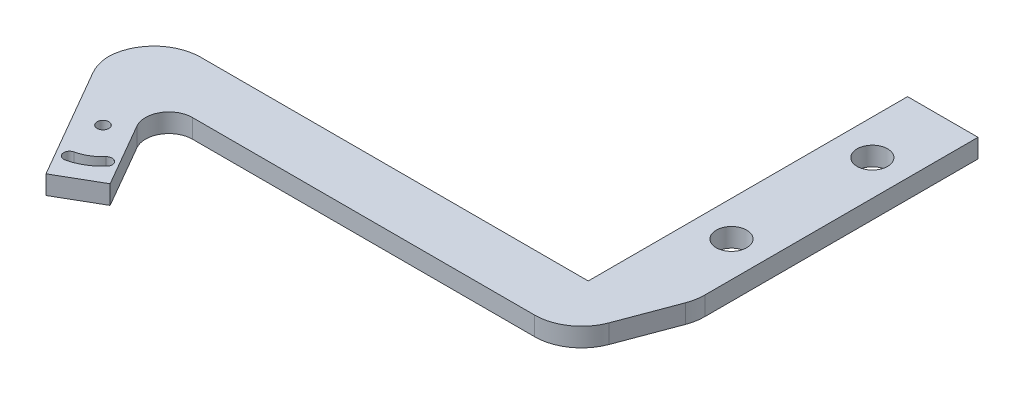
ISO-10303-21;
HEADER;
FILE_DESCRIPTION(('STEP AP214'),'2;1');
FILE_NAME('part.step','',(''),(''),'','','');
FILE_SCHEMA(('AUTOMOTIVE_DESIGN { 1 0 10303 214 1 1 1 1 }'));
ENDSEC;
DATA;
#1=APPLICATION_CONTEXT('core data for automotive mechanical design processes');
#2=APPLICATION_PROTOCOL_DEFINITION('international standard','automotive_design',2000,#1);
#3=PRODUCT_CONTEXT('',#1,'mechanical');
#4=PRODUCT('Part','Part','',(#3));
#5=PRODUCT_RELATED_PRODUCT_CATEGORY('part','',(#4));
#6=PRODUCT_DEFINITION_FORMATION('','',#4);
#7=PRODUCT_DEFINITION_CONTEXT('part definition',#1,'design');
#8=PRODUCT_DEFINITION('design','',#6,#7);
#9=PRODUCT_DEFINITION_SHAPE('','',#8);
#10=(LENGTH_UNIT() NAMED_UNIT(*) SI_UNIT(.MILLI.,.METRE.));
#11=(NAMED_UNIT(*) PLANE_ANGLE_UNIT() SI_UNIT($,.RADIAN.));
#12=(NAMED_UNIT(*) SI_UNIT($,.STERADIAN.) SOLID_ANGLE_UNIT());
#13=UNCERTAINTY_MEASURE_WITH_UNIT(LENGTH_MEASURE(1.E-05),#10,'distance_accuracy_value','');
#14=(GEOMETRIC_REPRESENTATION_CONTEXT(3) GLOBAL_UNCERTAINTY_ASSIGNED_CONTEXT((#13)) GLOBAL_UNIT_ASSIGNED_CONTEXT((#10,
#11,#12)) REPRESENTATION_CONTEXT('',''));
#15=CARTESIAN_POINT('',(0.,0.,0.));
#16=DIRECTION('',(0.,0.,1.));
#17=DIRECTION('',(1.,0.,0.));
#18=AXIS2_PLACEMENT_3D('',#15,#16,#17);
#19=CARTESIAN_POINT('',(0.,0.,0.));
#20=DIRECTION('',(0.,1.,0.));
#21=DIRECTION('',(0.,0.,1.));
#22=AXIS2_PLACEMENT_3D('',#19,#20,#21);
#23=PLANE('',#22);
#24=CARTESIAN_POINT('',(163.094010767585,0.,-15.));
#25=DIRECTION('',(0.,1.,0.));
#26=DIRECTION('',(0.,0.,1.));
#27=AXIS2_PLACEMENT_3D('',#24,#25,#26);
#28=CIRCLE('',#27,3.25000000000001);
#29=CARTESIAN_POINT('',(163.094010767585,0.,-11.75));
#30=VERTEX_POINT('',#29);
#31=EDGE_CURVE('E236',#30,#30,#28,.T.);
#32=ORIENTED_EDGE('',*,*,#31,.T.);
#33=EDGE_LOOP('',(#32));
#34=FACE_BOUND('',#33,.T.);
#35=CARTESIAN_POINT('',(163.094010767585,0.,15.));
#36=DIRECTION('',(0.,1.,0.));
#37=DIRECTION('',(0.,0.,1.));
#38=AXIS2_PLACEMENT_3D('',#35,#36,#37);
#39=CIRCLE('',#38,3.25000000000001);
#40=CARTESIAN_POINT('',(163.094010767585,0.,18.25));
#41=VERTEX_POINT('',#40);
#42=EDGE_CURVE('E243',#41,#41,#39,.T.);
#43=ORIENTED_EDGE('',*,*,#42,.T.);
#44=EDGE_LOOP('',(#43));
#45=FACE_BOUND('',#44,.T.);
#46=CARTESIAN_POINT('',(75.1741377865071,0.,60.9233937586589));
#47=DIRECTION('',(0.,1.,0.));
#48=DIRECTION('',(0.,0.,1.));
#49=AXIS2_PLACEMENT_3D('',#46,#47,#48);
#50=CIRCLE('',#49,1.25);
#51=CARTESIAN_POINT('',(75.1741377865071,0.,62.1733937586589));
#52=VERTEX_POINT('',#51);
#53=EDGE_CURVE('E249',#52,#52,#50,.T.);
#54=ORIENTED_EDGE('',*,*,#53,.T.);
#55=EDGE_LOOP('',(#54));
#56=FACE_BOUND('',#55,.T.);
#57=DIRECTION('',(-0.499999999999998,0.,-0.86602540378444));
#58=VECTOR('',#57,1.);
#59=CARTESIAN_POINT('',(78.0940107675848,0.,75.9807621135332));
#60=LINE('',#59,#58);
#61=CARTESIAN_POINT('',(78.0940107675848,0.,75.9807621135332));
#62=VERTEX_POINT('',#61);
#63=CARTESIAN_POINT('',(64.4337567297405,0.,52.3205080756888));
#64=VERTEX_POINT('',#63);
#65=EDGE_CURVE('E261',#62,#64,#60,.T.);
#66=ORIENTED_EDGE('',*,*,#65,.T.);
#67=CARTESIAN_POINT('',(73.0940107675849,0.,47.3205080756888));
#68=DIRECTION('',(0.,1.,0.));
#69=DIRECTION('',(0.,0.,1.));
#70=AXIS2_PLACEMENT_3D('',#67,#68,#69);
#71=CIRCLE('',#70,10.);
#72=CARTESIAN_POINT('',(63.0997837999201,0.,47.6602540378444));
#73=VERTEX_POINT('',#72);
#74=EDGE_CURVE('E323',#64,#73,#71,.F.);
#75=ORIENTED_EDGE('',*,*,#74,.T.);
#76=CARTESIAN_POINT('',(73.0940107675849,0.,48.));
#77=DIRECTION('',(0.,1.,0.));
#78=DIRECTION('',(0.,0.,1.));
#79=AXIS2_PLACEMENT_3D('',#76,#77,#78);
#80=CIRCLE('',#79,10.);
#81=CARTESIAN_POINT('',(73.0940107675849,0.,38.));
#82=VERTEX_POINT('',#81);
#83=EDGE_CURVE('E321',#73,#82,#80,.F.);
#84=ORIENTED_EDGE('',*,*,#83,.T.);
#85=DIRECTION('',(1.,0.,0.));
#86=VECTOR('',#85,1.);
#87=CARTESIAN_POINT('',(155.594010767585,0.,38.));
#88=LINE('',#87,#86);
#89=CARTESIAN_POINT('',(155.594010767585,0.,38.));
#90=VERTEX_POINT('',#89);
#91=EDGE_CURVE('E252',#82,#90,#88,.T.);
#92=ORIENTED_EDGE('',*,*,#91,.T.);
#93=DIRECTION('',(0.,0.,1.));
#94=VECTOR('',#93,1.);
#95=CARTESIAN_POINT('',(155.594010767585,0.,0.));
#96=LINE('',#95,#94);
#97=CARTESIAN_POINT('',(155.594010767585,0.,-30.));
#98=VERTEX_POINT('',#97);
#99=EDGE_CURVE('E266',#98,#90,#96,.T.);
#100=ORIENTED_EDGE('',*,*,#99,.F.);
#101=DIRECTION('',(-1.,0.,0.));
#102=VECTOR('',#101,1.);
#103=CARTESIAN_POINT('',(0.,0.,-30.));
#104=LINE('',#103,#102);
#105=CARTESIAN_POINT('',(170.594010767585,0.,-30.));
#106=VERTEX_POINT('',#105);
#107=EDGE_CURVE('E287',#106,#98,#104,.T.);
#108=ORIENTED_EDGE('',*,*,#107,.F.);
#109=DIRECTION('',(0.,0.,1.));
#110=VECTOR('',#109,1.);
#111=CARTESIAN_POINT('',(170.594010767585,0.,0.));
#112=LINE('',#111,#110);
#113=CARTESIAN_POINT('',(170.594010767585,0.,28.1866541822749));
#114=VERTEX_POINT('',#113);
#115=EDGE_CURVE('E284',#106,#114,#112,.T.);
#116=ORIENTED_EDGE('',*,*,#115,.T.);
#117=CARTESIAN_POINT('',(160.594010767585,0.,28.1866541822749));
#118=DIRECTION('',(0.,1.,0.));
#119=DIRECTION('',(0.,0.,1.));
#120=AXIS2_PLACEMENT_3D('',#117,#118,#119);
#121=CIRCLE('',#120,10.);
#122=CARTESIAN_POINT('',(169.957302543275,0.,31.6978885981588));
#123=VERTEX_POINT('',#122);
#124=EDGE_CURVE('E317',#114,#123,#121,.F.);
#125=ORIENTED_EDGE('',*,*,#124,.T.);
#126=DIRECTION('',(0.351123441588391,0.,-0.936329177569045));
#127=VECTOR('',#126,1.);
#128=CARTESIAN_POINT('',(159.424886152403,0.,59.784332307151));
#129=LINE('',#128,#127);
#130=CARTESIAN_POINT('',(165.527297861628,0.,43.5112344158839));
#131=VERTEX_POINT('',#130);
#132=EDGE_CURVE('E280',#131,#123,#129,.T.);
#133=ORIENTED_EDGE('',*,*,#132,.F.);
#134=CARTESIAN_POINT('',(156.164006085938,0.,40.));
#135=DIRECTION('',(0.,1.,0.));
#136=DIRECTION('',(0.,0.,1.));
#137=AXIS2_PLACEMENT_3D('',#134,#135,#136);
#138=CIRCLE('',#137,10.);
#139=CARTESIAN_POINT('',(156.164006085938,0.,50.));
#140=VERTEX_POINT('',#139);
#141=EDGE_CURVE('E319',#131,#140,#138,.F.);
#142=ORIENTED_EDGE('',*,*,#141,.T.);
#143=DIRECTION('',(-1.,0.,0.));
#144=VECTOR('',#143,1.);
#145=CARTESIAN_POINT('',(0.,0.,50.));
#146=LINE('',#145,#144);
#147=CARTESIAN_POINT('',(83.3012701892217,0.,50.));
#148=VERTEX_POINT('',#147);
#149=EDGE_CURVE('E278',#140,#148,#146,.T.);
#150=ORIENTED_EDGE('',*,*,#149,.T.);
#151=CARTESIAN_POINT('',(83.3012701892217,0.,55.));
#152=DIRECTION('',(0.,1.,0.));
#153=DIRECTION('',(0.,0.,1.));
#154=AXIS2_PLACEMENT_3D('',#151,#152,#153);
#155=CIRCLE('',#154,5.);
#156=CARTESIAN_POINT('',(78.9711431702995,0.,57.5));
#157=VERTEX_POINT('',#156);
#158=EDGE_CURVE('E81',#148,#157,#155,.T.);
#159=ORIENTED_EDGE('',*,*,#158,.T.);
#160=DIRECTION('',(-0.499999999999998,0.,-0.86602540378444));
#161=VECTOR('',#160,1.);
#162=CARTESIAN_POINT('',(86.7542648054292,0.,70.9807621135332));
#163=LINE('',#162,#161);
#164=CARTESIAN_POINT('',(86.7542648054292,0.,70.9807621135332));
#165=VERTEX_POINT('',#164);
#166=EDGE_CURVE('E309',#165,#157,#163,.T.);
#167=ORIENTED_EDGE('',*,*,#166,.F.);
#168=DIRECTION('',(-0.866025403784441,0.,0.499999999999996));
#169=VECTOR('',#168,1.);
#170=CARTESIAN_POINT('',(86.7542648054292,0.,70.9807621135332));
#171=LINE('',#170,#169);
#172=EDGE_CURVE('E300',#165,#62,#171,.T.);
#173=ORIENTED_EDGE('',*,*,#172,.T.);
#174=EDGE_LOOP('',(#66,#75,#84,#92,#100,#108,#116,#125,#133,#142,#150,#159,#167,#173));
#175=FACE_BOUND('',#174,.T.);
#176=CARTESIAN_POINT('',(75.1741377865071,0.,60.9233937586589));
#177=DIRECTION('',(0.,1.,0.));
#178=DIRECTION('',(0.,0.,-1.));
#179=AXIS2_PLACEMENT_3D('',#176,#177,#178);
#180=CIRCLE('',#179,10.75);
#181=CARTESIAN_POINT('',(77.5923616207036,0.,71.3978719551002));
#182=VERTEX_POINT('',#181);
#183=CARTESIAN_POINT('',(83.1629446603891,0.,68.1165477770166));
#184=VERTEX_POINT('',#183);
#185=EDGE_CURVE('E208',#182,#184,#180,.T.);
#186=ORIENTED_EDGE('',*,*,#185,.T.);
#187=CARTESIAN_POINT('',(82.2340136285423,0.,67.280134519068));
#188=DIRECTION('',(0.,1.,0.));
#189=DIRECTION('',(0.,0.,1.));
#190=AXIS2_PLACEMENT_3D('',#187,#188,#189);
#191=CIRCLE('',#190,1.25);
#192=CARTESIAN_POINT('',(81.3050825966956,0.,66.4437212611194));
#193=VERTEX_POINT('',#192);
#194=EDGE_CURVE('E202',#184,#193,#191,.T.);
#195=ORIENTED_EDGE('',*,*,#194,.T.);
#196=CARTESIAN_POINT('',(75.1741377865071,0.,60.9233937586589));
#197=DIRECTION('',(0.,-1.,0.));
#198=DIRECTION('',(0.,0.,-1.));
#199=AXIS2_PLACEMENT_3D('',#196,#197,#198);
#200=CIRCLE('',#199,8.25);
#201=CARTESIAN_POINT('',(77.0299839848439,0.,68.9619467931371));
#202=VERTEX_POINT('',#201);
#203=EDGE_CURVE('E88',#193,#202,#200,.T.);
#204=ORIENTED_EDGE('',*,*,#203,.T.);
#205=CARTESIAN_POINT('',(77.3111728027738,0.,70.1799093741186));
#206=DIRECTION('',(0.,1.,0.));
#207=DIRECTION('',(0.,0.,1.));
#208=AXIS2_PLACEMENT_3D('',#205,#206,#207);
#209=CIRCLE('',#208,1.25);
#210=EDGE_CURVE('E213',#202,#182,#209,.T.);
#211=ORIENTED_EDGE('',*,*,#210,.T.);
#212=EDGE_LOOP('',(#186,#195,#204,#211));
#213=FACE_BOUND('',#212,.T.);
#214=ADVANCED_FACE('F73',(#34,#45,#56,#175,#213),#23,.F.);
#215=CARTESIAN_POINT('',(0.,4.,0.));
#216=DIRECTION('',(0.,1.,0.));
#217=DIRECTION('',(0.,0.,1.));
#218=AXIS2_PLACEMENT_3D('',#215,#216,#217);
#219=PLANE('',#218);
#220=CARTESIAN_POINT('',(163.094010767585,4.,-15.));
#221=DIRECTION('',(0.,1.,0.));
#222=DIRECTION('',(0.,0.,1.));
#223=AXIS2_PLACEMENT_3D('',#220,#221,#222);
#224=CIRCLE('',#223,3.25000000000001);
#225=CARTESIAN_POINT('',(163.094010767585,4.,-11.75));
#226=VERTEX_POINT('',#225);
#227=EDGE_CURVE('E240',#226,#226,#224,.T.);
#228=ORIENTED_EDGE('',*,*,#227,.F.);
#229=EDGE_LOOP('',(#228));
#230=FACE_BOUND('',#229,.T.);
#231=CARTESIAN_POINT('',(163.094010767585,4.,15.));
#232=DIRECTION('',(0.,1.,0.));
#233=DIRECTION('',(0.,0.,1.));
#234=AXIS2_PLACEMENT_3D('',#231,#232,#233);
#235=CIRCLE('',#234,3.25000000000001);
#236=CARTESIAN_POINT('',(163.094010767585,4.,18.25));
#237=VERTEX_POINT('',#236);
#238=EDGE_CURVE('E246',#237,#237,#235,.T.);
#239=ORIENTED_EDGE('',*,*,#238,.F.);
#240=EDGE_LOOP('',(#239));
#241=FACE_BOUND('',#240,.T.);
#242=CARTESIAN_POINT('',(75.1741377865071,4.,60.9233937586589));
#243=DIRECTION('',(0.,1.,0.));
#244=DIRECTION('',(0.,0.,1.));
#245=AXIS2_PLACEMENT_3D('',#242,#243,#244);
#246=CIRCLE('',#245,1.25);
#247=CARTESIAN_POINT('',(75.1741377865071,4.,62.1733937586589));
#248=VERTEX_POINT('',#247);
#249=EDGE_CURVE('E239',#248,#248,#246,.T.);
#250=ORIENTED_EDGE('',*,*,#249,.F.);
#251=EDGE_LOOP('',(#250));
#252=FACE_BOUND('',#251,.T.);
#253=CARTESIAN_POINT('',(73.0940107675849,4.,48.));
#254=DIRECTION('',(0.,1.,0.));
#255=DIRECTION('',(0.,0.,1.));
#256=AXIS2_PLACEMENT_3D('',#253,#254,#255);
#257=CIRCLE('',#256,10.);
#258=CARTESIAN_POINT('',(73.0940107675849,4.,38.));
#259=VERTEX_POINT('',#258);
#260=CARTESIAN_POINT('',(63.0997837999201,4.,47.6602540378444));
#261=VERTEX_POINT('',#260);
#262=EDGE_CURVE('E329',#259,#261,#257,.T.);
#263=ORIENTED_EDGE('',*,*,#262,.T.);
#264=CARTESIAN_POINT('',(73.0940107675849,4.,47.3205080756888));
#265=DIRECTION('',(0.,1.,0.));
#266=DIRECTION('',(0.,0.,1.));
#267=AXIS2_PLACEMENT_3D('',#264,#265,#266);
#268=CIRCLE('',#267,10.);
#269=CARTESIAN_POINT('',(64.4337567297405,4.,52.3205080756888));
#270=VERTEX_POINT('',#269);
#271=EDGE_CURVE('E331',#261,#270,#268,.T.);
#272=ORIENTED_EDGE('',*,*,#271,.T.);
#273=DIRECTION('',(-0.499999999999998,0.,-0.86602540378444));
#274=VECTOR('',#273,1.);
#275=CARTESIAN_POINT('',(78.0940107675848,4.,75.9807621135332));
#276=LINE('',#275,#274);
#277=CARTESIAN_POINT('',(78.0940107675848,4.,75.9807621135332));
#278=VERTEX_POINT('',#277);
#279=EDGE_CURVE('E296',#278,#270,#276,.T.);
#280=ORIENTED_EDGE('',*,*,#279,.F.);
#281=DIRECTION('',(-0.866025403784441,0.,0.499999999999996));
#282=VECTOR('',#281,1.);
#283=CARTESIAN_POINT('',(86.7542648054292,4.,70.9807621135332));
#284=LINE('',#283,#282);
#285=CARTESIAN_POINT('',(86.7542648054292,4.,70.9807621135332));
#286=VERTEX_POINT('',#285);
#287=EDGE_CURVE('E303',#286,#278,#284,.T.);
#288=ORIENTED_EDGE('',*,*,#287,.F.);
#289=DIRECTION('',(-0.499999999999998,0.,-0.86602540378444));
#290=VECTOR('',#289,1.);
#291=CARTESIAN_POINT('',(86.7542648054292,4.,70.9807621135332));
#292=LINE('',#291,#290);
#293=CARTESIAN_POINT('',(78.9711431702995,4.,57.5));
#294=VERTEX_POINT('',#293);
#295=EDGE_CURVE('E299',#286,#294,#292,.T.);
#296=ORIENTED_EDGE('',*,*,#295,.T.);
#297=CARTESIAN_POINT('',(83.3012701892217,4.,55.));
#298=DIRECTION('',(0.,1.,0.));
#299=DIRECTION('',(0.,0.,1.));
#300=AXIS2_PLACEMENT_3D('',#297,#298,#299);
#301=CIRCLE('',#300,5.);
#302=CARTESIAN_POINT('',(83.3012701892217,4.,50.));
#303=VERTEX_POINT('',#302);
#304=EDGE_CURVE('E12',#294,#303,#301,.F.);
#305=ORIENTED_EDGE('',*,*,#304,.T.);
#306=DIRECTION('',(-1.,0.,0.));
#307=VECTOR('',#306,1.);
#308=CARTESIAN_POINT('',(0.,4.,50.));
#309=LINE('',#308,#307);
#310=CARTESIAN_POINT('',(156.164006085938,4.,50.));
#311=VERTEX_POINT('',#310);
#312=EDGE_CURVE('E262',#311,#303,#309,.T.);
#313=ORIENTED_EDGE('',*,*,#312,.F.);
#314=CARTESIAN_POINT('',(156.164006085938,4.,40.));
#315=DIRECTION('',(0.,1.,0.));
#316=DIRECTION('',(0.,0.,1.));
#317=AXIS2_PLACEMENT_3D('',#314,#315,#316);
#318=CIRCLE('',#317,10.);
#319=CARTESIAN_POINT('',(165.527297861628,4.,43.5112344158839));
#320=VERTEX_POINT('',#319);
#321=EDGE_CURVE('E327',#311,#320,#318,.T.);
#322=ORIENTED_EDGE('',*,*,#321,.T.);
#323=DIRECTION('',(0.351123441588391,0.,-0.936329177569045));
#324=VECTOR('',#323,1.);
#325=CARTESIAN_POINT('',(159.424886152403,4.,59.784332307151));
#326=LINE('',#325,#324);
#327=CARTESIAN_POINT('',(169.957302543275,4.,31.6978885981588));
#328=VERTEX_POINT('',#327);
#329=EDGE_CURVE('E265',#320,#328,#326,.T.);
#330=ORIENTED_EDGE('',*,*,#329,.T.);
#331=CARTESIAN_POINT('',(160.594010767585,4.,28.1866541822749));
#332=DIRECTION('',(0.,1.,0.));
#333=DIRECTION('',(0.,0.,1.));
#334=AXIS2_PLACEMENT_3D('',#331,#332,#333);
#335=CIRCLE('',#334,10.);
#336=CARTESIAN_POINT('',(170.594010767585,4.,28.1866541822749));
#337=VERTEX_POINT('',#336);
#338=EDGE_CURVE('E325',#328,#337,#335,.T.);
#339=ORIENTED_EDGE('',*,*,#338,.T.);
#340=DIRECTION('',(0.,0.,1.));
#341=VECTOR('',#340,1.);
#342=CARTESIAN_POINT('',(170.594010767585,4.,0.));
#343=LINE('',#342,#341);
#344=CARTESIAN_POINT('',(170.594010767585,4.,-30.));
#345=VERTEX_POINT('',#344);
#346=EDGE_CURVE('E269',#345,#337,#343,.T.);
#347=ORIENTED_EDGE('',*,*,#346,.F.);
#348=DIRECTION('',(-1.,0.,0.));
#349=VECTOR('',#348,1.);
#350=CARTESIAN_POINT('',(0.,4.,-30.));
#351=LINE('',#350,#349);
#352=CARTESIAN_POINT('',(155.594010767585,4.,-30.));
#353=VERTEX_POINT('',#352);
#354=EDGE_CURVE('E272',#345,#353,#351,.T.);
#355=ORIENTED_EDGE('',*,*,#354,.T.);
#356=DIRECTION('',(0.,0.,1.));
#357=VECTOR('',#356,1.);
#358=CARTESIAN_POINT('',(155.594010767585,4.,0.));
#359=LINE('',#358,#357);
#360=CARTESIAN_POINT('',(155.594010767585,4.,38.));
#361=VERTEX_POINT('',#360);
#362=EDGE_CURVE('E274',#353,#361,#359,.T.);
#363=ORIENTED_EDGE('',*,*,#362,.T.);
#364=DIRECTION('',(1.,0.,0.));
#365=VECTOR('',#364,1.);
#366=CARTESIAN_POINT('',(155.594010767585,4.,38.));
#367=LINE('',#366,#365);
#368=EDGE_CURVE('E255',#259,#361,#367,.T.);
#369=ORIENTED_EDGE('',*,*,#368,.F.);
#370=EDGE_LOOP('',(#263,#272,#280,#288,#296,#305,#313,#322,#330,#339,#347,#355,#363,#369));
#371=FACE_BOUND('',#370,.T.);
#372=CARTESIAN_POINT('',(75.1741377865071,4.,60.9233937586589));
#373=DIRECTION('',(0.,1.,0.));
#374=DIRECTION('',(0.,0.,-1.));
#375=AXIS2_PLACEMENT_3D('',#372,#373,#374);
#376=CIRCLE('',#375,10.75);
#377=CARTESIAN_POINT('',(77.5923616207036,4.,71.3978719551002));
#378=VERTEX_POINT('',#377);
#379=CARTESIAN_POINT('',(83.1629446603891,4.,68.1165477770166));
#380=VERTEX_POINT('',#379);
#381=EDGE_CURVE('E217',#378,#380,#376,.T.);
#382=ORIENTED_EDGE('',*,*,#381,.F.);
#383=CARTESIAN_POINT('',(77.3111728027738,4.,70.1799093741186));
#384=DIRECTION('',(0.,1.,0.));
#385=DIRECTION('',(0.,0.,1.));
#386=AXIS2_PLACEMENT_3D('',#383,#384,#385);
#387=CIRCLE('',#386,1.25);
#388=CARTESIAN_POINT('',(77.0299839848439,4.,68.9619467931371));
#389=VERTEX_POINT('',#388);
#390=EDGE_CURVE('E219',#389,#378,#387,.T.);
#391=ORIENTED_EDGE('',*,*,#390,.F.);
#392=CARTESIAN_POINT('',(75.1741377865071,4.,60.9233937586589));
#393=DIRECTION('',(0.,-1.,0.));
#394=DIRECTION('',(0.,0.,-1.));
#395=AXIS2_PLACEMENT_3D('',#392,#393,#394);
#396=CIRCLE('',#395,8.25);
#397=CARTESIAN_POINT('',(81.3050825966956,4.,66.4437212611194));
#398=VERTEX_POINT('',#397);
#399=EDGE_CURVE('E225',#398,#389,#396,.T.);
#400=ORIENTED_EDGE('',*,*,#399,.F.);
#401=CARTESIAN_POINT('',(82.2340136285423,4.,67.280134519068));
#402=DIRECTION('',(0.,1.,0.));
#403=DIRECTION('',(0.,0.,1.));
#404=AXIS2_PLACEMENT_3D('',#401,#402,#403);
#405=CIRCLE('',#404,1.25);
#406=EDGE_CURVE('E204',#380,#398,#405,.T.);
#407=ORIENTED_EDGE('',*,*,#406,.F.);
#408=EDGE_LOOP('',(#382,#391,#400,#407));
#409=FACE_BOUND('',#408,.T.);
#410=ADVANCED_FACE('F359',(#230,#241,#252,#371,#409),#219,.T.);
#411=CARTESIAN_POINT('',(159.424886152403,4.,59.784332307151));
#412=DIRECTION('',(-0.936329177569045,0.,-0.351123441588391));
#413=DIRECTION('',(-0.351123441588391,0.,0.936329177569045));
#414=AXIS2_PLACEMENT_3D('',#411,#412,#413);
#415=PLANE('',#414);
#416=ORIENTED_EDGE('',*,*,#329,.F.);
#417=DIRECTION('',(0.,-1.,0.));
#418=VECTOR('',#417,1.);
#419=CARTESIAN_POINT('',(165.527297861628,0.,43.5112344158839));
#420=LINE('',#419,#418);
#421=EDGE_CURVE('E337',#320,#131,#420,.T.);
#422=ORIENTED_EDGE('',*,*,#421,.T.);
#423=ORIENTED_EDGE('',*,*,#132,.T.);
#424=DIRECTION('',(0.,-1.,0.));
#425=VECTOR('',#424,1.);
#426=CARTESIAN_POINT('',(169.957302543275,4.,31.6978885981588));
#427=LINE('',#426,#425);
#428=EDGE_CURVE('E335',#123,#328,#427,.F.);
#429=ORIENTED_EDGE('',*,*,#428,.T.);
#430=EDGE_LOOP('',(#416,#422,#423,#429));
#431=FACE_BOUND('',#430,.T.);
#432=ADVANCED_FACE('F375',(#431),#415,.F.);
#433=CARTESIAN_POINT('',(170.594010767585,4.,0.));
#434=DIRECTION('',(1.,0.,0.));
#435=DIRECTION('',(0.,0.,-1.));
#436=AXIS2_PLACEMENT_3D('',#433,#434,#435);
#437=PLANE('',#436);
#438=ORIENTED_EDGE('',*,*,#346,.T.);
#439=DIRECTION('',(0.,-1.,0.));
#440=VECTOR('',#439,1.);
#441=CARTESIAN_POINT('',(170.594010767585,0.,28.1866541822749));
#442=LINE('',#441,#440);
#443=EDGE_CURVE('E342',#337,#114,#442,.T.);
#444=ORIENTED_EDGE('',*,*,#443,.T.);
#445=ORIENTED_EDGE('',*,*,#115,.F.);
#446=DIRECTION('',(0.,-1.,0.));
#447=VECTOR('',#446,1.);
#448=CARTESIAN_POINT('',(170.594010767585,4.,-30.));
#449=LINE('',#448,#447);
#450=EDGE_CURVE('E293',#345,#106,#449,.T.);
#451=ORIENTED_EDGE('',*,*,#450,.F.);
#452=EDGE_LOOP('',(#438,#444,#445,#451));
#453=FACE_BOUND('',#452,.T.);
#454=ADVANCED_FACE('F384',(#453),#437,.T.);
#455=CARTESIAN_POINT('',(0.,4.,-30.));
#456=DIRECTION('',(0.,0.,1.));
#457=DIRECTION('',(1.,0.,0.));
#458=AXIS2_PLACEMENT_3D('',#455,#456,#457);
#459=PLANE('',#458);
#460=ORIENTED_EDGE('',*,*,#107,.T.);
#461=DIRECTION('',(0.,-1.,0.));
#462=VECTOR('',#461,1.);
#463=CARTESIAN_POINT('',(155.594010767585,4.,-30.));
#464=LINE('',#463,#462);
#465=EDGE_CURVE('E277',#353,#98,#464,.T.);
#466=ORIENTED_EDGE('',*,*,#465,.F.);
#467=ORIENTED_EDGE('',*,*,#354,.F.);
#468=ORIENTED_EDGE('',*,*,#450,.T.);
#469=EDGE_LOOP('',(#460,#466,#467,#468));
#470=FACE_BOUND('',#469,.T.);
#471=ADVANCED_FACE('F389',(#470),#459,.F.);
#472=CARTESIAN_POINT('',(155.594010767585,4.,0.));
#473=DIRECTION('',(1.,0.,0.));
#474=DIRECTION('',(0.,0.,-1.));
#475=AXIS2_PLACEMENT_3D('',#472,#473,#474);
#476=PLANE('',#475);
#477=ORIENTED_EDGE('',*,*,#99,.T.);
#478=DIRECTION('',(0.,-1.,0.));
#479=VECTOR('',#478,1.);
#480=CARTESIAN_POINT('',(155.594010767585,4.,38.));
#481=LINE('',#480,#479);
#482=EDGE_CURVE('E257',#361,#90,#481,.T.);
#483=ORIENTED_EDGE('',*,*,#482,.F.);
#484=ORIENTED_EDGE('',*,*,#362,.F.);
#485=ORIENTED_EDGE('',*,*,#465,.T.);
#486=EDGE_LOOP('',(#477,#483,#484,#485));
#487=FACE_BOUND('',#486,.T.);
#488=ADVANCED_FACE('F393',(#487),#476,.F.);
#489=CARTESIAN_POINT('',(0.,4.,50.));
#490=DIRECTION('',(0.,0.,1.));
#491=DIRECTION('',(1.,0.,0.));
#492=AXIS2_PLACEMENT_3D('',#489,#490,#491);
#493=PLANE('',#492);
#494=ORIENTED_EDGE('',*,*,#312,.T.);
#495=DIRECTION('',(0.,-1.,0.));
#496=VECTOR('',#495,1.);
#497=CARTESIAN_POINT('',(83.3012701892217,4.,50.));
#498=LINE('',#497,#496);
#499=EDGE_CURVE('E345',#303,#148,#498,.T.);
#500=ORIENTED_EDGE('',*,*,#499,.T.);
#501=ORIENTED_EDGE('',*,*,#149,.F.);
#502=DIRECTION('',(0.,-1.,0.));
#503=VECTOR('',#502,1.);
#504=CARTESIAN_POINT('',(156.164006085938,4.,50.));
#505=LINE('',#504,#503);
#506=EDGE_CURVE('E340',#140,#311,#505,.F.);
#507=ORIENTED_EDGE('',*,*,#506,.T.);
#508=EDGE_LOOP('',(#494,#500,#501,#507));
#509=FACE_BOUND('',#508,.T.);
#510=ADVANCED_FACE('F366',(#509),#493,.T.);
#511=CARTESIAN_POINT('',(86.7542648054292,4.,70.9807621135332));
#512=DIRECTION('',(0.499999999999996,0.,0.866025403784441));
#513=DIRECTION('',(0.866025403784441,0.,-0.499999999999996));
#514=AXIS2_PLACEMENT_3D('',#511,#512,#513);
#515=PLANE('',#514);
#516=ORIENTED_EDGE('',*,*,#172,.F.);
#517=DIRECTION('',(0.,-1.,0.));
#518=VECTOR('',#517,1.);
#519=CARTESIAN_POINT('',(86.7542648054292,4.,70.9807621135332));
#520=LINE('',#519,#518);
#521=EDGE_CURVE('E306',#286,#165,#520,.T.);
#522=ORIENTED_EDGE('',*,*,#521,.F.);
#523=ORIENTED_EDGE('',*,*,#287,.T.);
#524=DIRECTION('',(0.,-1.,0.));
#525=VECTOR('',#524,1.);
#526=CARTESIAN_POINT('',(78.0940107675848,4.,75.9807621135332));
#527=LINE('',#526,#525);
#528=EDGE_CURVE('E281',#278,#62,#527,.T.);
#529=ORIENTED_EDGE('',*,*,#528,.T.);
#530=EDGE_LOOP('',(#516,#522,#523,#529));
#531=FACE_BOUND('',#530,.T.);
#532=ADVANCED_FACE('F412',(#531),#515,.T.);
#533=CARTESIAN_POINT('',(86.7542648054292,4.,70.9807621135332));
#534=DIRECTION('',(-0.86602540378444,0.,0.499999999999998));
#535=DIRECTION('',(0.499999999999998,0.,0.86602540378444));
#536=AXIS2_PLACEMENT_3D('',#533,#534,#535);
#537=PLANE('',#536);
#538=ORIENTED_EDGE('',*,*,#166,.T.);
#539=DIRECTION('',(0.,-1.,0.));
#540=VECTOR('',#539,1.);
#541=CARTESIAN_POINT('',(78.9711431702995,4.,57.5));
#542=LINE('',#541,#540);
#543=EDGE_CURVE('E350',#157,#294,#542,.F.);
#544=ORIENTED_EDGE('',*,*,#543,.T.);
#545=ORIENTED_EDGE('',*,*,#295,.F.);
#546=ORIENTED_EDGE('',*,*,#521,.T.);
#547=EDGE_LOOP('',(#538,#544,#545,#546));
#548=FACE_BOUND('',#547,.T.);
#549=ADVANCED_FACE('F354',(#548),#537,.F.);
#550=CARTESIAN_POINT('',(78.0940107675848,4.,75.9807621135332));
#551=DIRECTION('',(-0.86602540378444,0.,0.499999999999998));
#552=DIRECTION('',(0.499999999999998,0.,0.86602540378444));
#553=AXIS2_PLACEMENT_3D('',#550,#551,#552);
#554=PLANE('',#553);
#555=ORIENTED_EDGE('',*,*,#279,.T.);
#556=DIRECTION('',(0.,-1.,0.));
#557=VECTOR('',#556,1.);
#558=CARTESIAN_POINT('',(64.4337567297405,0.,52.3205080756888));
#559=LINE('',#558,#557);
#560=EDGE_CURVE('E295',#270,#64,#559,.T.);
#561=ORIENTED_EDGE('',*,*,#560,.T.);
#562=ORIENTED_EDGE('',*,*,#65,.F.);
#563=ORIENTED_EDGE('',*,*,#528,.F.);
#564=EDGE_LOOP('',(#555,#561,#562,#563));
#565=FACE_BOUND('',#564,.T.);
#566=ADVANCED_FACE('F408',(#565),#554,.T.);
#567=CARTESIAN_POINT('',(155.594010767585,4.,38.));
#568=DIRECTION('',(0.,0.,-1.));
#569=DIRECTION('',(-1.,0.,0.));
#570=AXIS2_PLACEMENT_3D('',#567,#568,#569);
#571=PLANE('',#570);
#572=ORIENTED_EDGE('',*,*,#91,.F.);
#573=DIRECTION('',(0.,-1.,0.));
#574=VECTOR('',#573,1.);
#575=CARTESIAN_POINT('',(73.0940107675849,4.,38.));
#576=LINE('',#575,#574);
#577=EDGE_CURVE('E333',#82,#259,#576,.F.);
#578=ORIENTED_EDGE('',*,*,#577,.T.);
#579=ORIENTED_EDGE('',*,*,#368,.T.);
#580=ORIENTED_EDGE('',*,*,#482,.T.);
#581=EDGE_LOOP('',(#572,#578,#579,#580));
#582=FACE_BOUND('',#581,.T.);
#583=ADVANCED_FACE('F414',(#582),#571,.T.);
#584=CARTESIAN_POINT('',(75.1741377865071,0.,60.9233937586589));
#585=DIRECTION('',(0.,1.,0.));
#586=DIRECTION('',(0.,0.,1.));
#587=AXIS2_PLACEMENT_3D('',#584,#585,#586);
#588=CYLINDRICAL_SURFACE('',#587,1.25);
#589=ORIENTED_EDGE('',*,*,#53,.F.);
#590=EDGE_LOOP('',(#589));
#591=FACE_BOUND('',#590,.T.);
#592=ORIENTED_EDGE('',*,*,#249,.T.);
#593=EDGE_LOOP('',(#592));
#594=FACE_BOUND('',#593,.T.);
#595=ADVANCED_FACE('F416',(#591,#594),#588,.F.);
#596=CARTESIAN_POINT('',(163.094010767585,0.,15.));
#597=DIRECTION('',(0.,1.,0.));
#598=DIRECTION('',(0.,0.,1.));
#599=AXIS2_PLACEMENT_3D('',#596,#597,#598);
#600=CYLINDRICAL_SURFACE('',#599,3.25000000000001);
#601=ORIENTED_EDGE('',*,*,#42,.F.);
#602=EDGE_LOOP('',(#601));
#603=FACE_BOUND('',#602,.T.);
#604=ORIENTED_EDGE('',*,*,#238,.T.);
#605=EDGE_LOOP('',(#604));
#606=FACE_BOUND('',#605,.T.);
#607=ADVANCED_FACE('F422',(#603,#606),#600,.F.);
#608=CARTESIAN_POINT('',(163.094010767585,0.,-15.));
#609=DIRECTION('',(0.,1.,0.));
#610=DIRECTION('',(0.,0.,1.));
#611=AXIS2_PLACEMENT_3D('',#608,#609,#610);
#612=CYLINDRICAL_SURFACE('',#611,3.25000000000001);
#613=ORIENTED_EDGE('',*,*,#31,.F.);
#614=EDGE_LOOP('',(#613));
#615=FACE_BOUND('',#614,.T.);
#616=ORIENTED_EDGE('',*,*,#227,.T.);
#617=EDGE_LOOP('',(#616));
#618=FACE_BOUND('',#617,.T.);
#619=ADVANCED_FACE('F454',(#615,#618),#612,.F.);
#620=CARTESIAN_POINT('',(73.0940107675849,4.,48.));
#621=DIRECTION('',(0.,1.,0.));
#622=DIRECTION('',(0.,0.,1.));
#623=AXIS2_PLACEMENT_3D('',#620,#621,#622);
#624=CYLINDRICAL_SURFACE('',#623,10.);
#625=DIRECTION('',(0.,1.,0.));
#626=VECTOR('',#625,1.);
#627=CARTESIAN_POINT('',(63.0997837999201,2.,47.6602540378444));
#628=LINE('',#627,#626);
#629=EDGE_CURVE('E231',#261,#73,#628,.F.);
#630=ORIENTED_EDGE('',*,*,#629,.F.);
#631=ORIENTED_EDGE('',*,*,#262,.F.);
#632=ORIENTED_EDGE('',*,*,#577,.F.);
#633=ORIENTED_EDGE('',*,*,#83,.F.);
#634=EDGE_LOOP('',(#630,#631,#632,#633));
#635=FACE_BOUND('',#634,.T.);
#636=ADVANCED_FACE('F401',(#635),#624,.T.);
#637=CARTESIAN_POINT('',(73.0940107675849,4.,47.3205080756888));
#638=DIRECTION('',(0.,1.,0.));
#639=DIRECTION('',(0.,0.,1.));
#640=AXIS2_PLACEMENT_3D('',#637,#638,#639);
#641=CYLINDRICAL_SURFACE('',#640,10.);
#642=ORIENTED_EDGE('',*,*,#271,.F.);
#643=ORIENTED_EDGE('',*,*,#629,.T.);
#644=ORIENTED_EDGE('',*,*,#74,.F.);
#645=ORIENTED_EDGE('',*,*,#560,.F.);
#646=EDGE_LOOP('',(#642,#643,#644,#645));
#647=FACE_BOUND('',#646,.T.);
#648=ADVANCED_FACE('F406',(#647),#641,.T.);
#649=CARTESIAN_POINT('',(156.164006085938,4.,40.));
#650=DIRECTION('',(0.,1.,0.));
#651=DIRECTION('',(0.,0.,1.));
#652=AXIS2_PLACEMENT_3D('',#649,#650,#651);
#653=CYLINDRICAL_SURFACE('',#652,10.);
#654=ORIENTED_EDGE('',*,*,#321,.F.);
#655=ORIENTED_EDGE('',*,*,#506,.F.);
#656=ORIENTED_EDGE('',*,*,#141,.F.);
#657=ORIENTED_EDGE('',*,*,#421,.F.);
#658=EDGE_LOOP('',(#654,#655,#656,#657));
#659=FACE_BOUND('',#658,.T.);
#660=ADVANCED_FACE('F372',(#659),#653,.T.);
#661=CARTESIAN_POINT('',(160.594010767585,4.,28.1866541822749));
#662=DIRECTION('',(0.,1.,0.));
#663=DIRECTION('',(0.,0.,1.));
#664=AXIS2_PLACEMENT_3D('',#661,#662,#663);
#665=CYLINDRICAL_SURFACE('',#664,10.);
#666=ORIENTED_EDGE('',*,*,#338,.F.);
#667=ORIENTED_EDGE('',*,*,#428,.F.);
#668=ORIENTED_EDGE('',*,*,#124,.F.);
#669=ORIENTED_EDGE('',*,*,#443,.F.);
#670=EDGE_LOOP('',(#666,#667,#668,#669));
#671=FACE_BOUND('',#670,.T.);
#672=ADVANCED_FACE('F381',(#671),#665,.T.);
#673=CARTESIAN_POINT('',(83.3012701892217,4.,55.));
#674=DIRECTION('',(0.,-1.,0.));
#675=DIRECTION('',(0.,0.,-1.));
#676=AXIS2_PLACEMENT_3D('',#673,#674,#675);
#677=CYLINDRICAL_SURFACE('',#676,5.);
#678=ORIENTED_EDGE('',*,*,#304,.F.);
#679=ORIENTED_EDGE('',*,*,#543,.F.);
#680=ORIENTED_EDGE('',*,*,#158,.F.);
#681=ORIENTED_EDGE('',*,*,#499,.F.);
#682=EDGE_LOOP('',(#678,#679,#680,#681));
#683=FACE_BOUND('',#682,.T.);
#684=ADVANCED_FACE('F75',(#683),#677,.F.);
#685=CARTESIAN_POINT('',(75.1741377865071,0.,60.9233937586589));
#686=DIRECTION('',(0.,1.,0.));
#687=DIRECTION('',(0.,0.,1.));
#688=AXIS2_PLACEMENT_3D('',#685,#686,#687);
#689=CYLINDRICAL_SURFACE('',#688,10.75);
#690=ORIENTED_EDGE('',*,*,#185,.F.);
#691=DIRECTION('',(0.,1.,0.));
#692=VECTOR('',#691,1.);
#693=CARTESIAN_POINT('',(77.5923616207036,0.,71.3978719551002));
#694=LINE('',#693,#692);
#695=EDGE_CURVE('E232',#182,#378,#694,.T.);
#696=ORIENTED_EDGE('',*,*,#695,.T.);
#697=ORIENTED_EDGE('',*,*,#381,.T.);
#698=DIRECTION('',(0.,1.,0.));
#699=VECTOR('',#698,1.);
#700=CARTESIAN_POINT('',(83.1629446603891,0.,68.1165477770166));
#701=LINE('',#700,#699);
#702=EDGE_CURVE('E229',#184,#380,#701,.T.);
#703=ORIENTED_EDGE('',*,*,#702,.F.);
#704=EDGE_LOOP('',(#690,#696,#697,#703));
#705=FACE_BOUND('',#704,.T.);
#706=ADVANCED_FACE('F460',(#705),#689,.F.);
#707=CARTESIAN_POINT('',(75.1741377865071,0.,60.9233937586589));
#708=DIRECTION('',(0.,1.,0.));
#709=DIRECTION('',(0.,0.,1.));
#710=AXIS2_PLACEMENT_3D('',#707,#708,#709);
#711=CYLINDRICAL_SURFACE('',#710,8.25);
#712=ORIENTED_EDGE('',*,*,#203,.F.);
#713=DIRECTION('',(0.,1.,0.));
#714=VECTOR('',#713,1.);
#715=CARTESIAN_POINT('',(81.3050825966956,0.,66.4437212611194));
#716=LINE('',#715,#714);
#717=EDGE_CURVE('E199',#193,#398,#716,.T.);
#718=ORIENTED_EDGE('',*,*,#717,.T.);
#719=ORIENTED_EDGE('',*,*,#399,.T.);
#720=DIRECTION('',(0.,1.,0.));
#721=VECTOR('',#720,1.);
#722=CARTESIAN_POINT('',(77.0299839848439,0.,68.9619467931371));
#723=LINE('',#722,#721);
#724=EDGE_CURVE('E207',#202,#389,#723,.T.);
#725=ORIENTED_EDGE('',*,*,#724,.F.);
#726=EDGE_LOOP('',(#712,#718,#719,#725));
#727=FACE_BOUND('',#726,.T.);
#728=ADVANCED_FACE('F211',(#727),#711,.T.);
#729=CARTESIAN_POINT('',(82.2340136285423,0.,67.280134519068));
#730=DIRECTION('',(0.,1.,0.));
#731=DIRECTION('',(0.,0.,1.));
#732=AXIS2_PLACEMENT_3D('',#729,#730,#731);
#733=CYLINDRICAL_SURFACE('',#732,1.25);
#734=ORIENTED_EDGE('',*,*,#406,.T.);
#735=ORIENTED_EDGE('',*,*,#717,.F.);
#736=ORIENTED_EDGE('',*,*,#194,.F.);
#737=ORIENTED_EDGE('',*,*,#702,.T.);
#738=EDGE_LOOP('',(#734,#735,#736,#737));
#739=FACE_BOUND('',#738,.T.);
#740=ADVANCED_FACE('F200',(#739),#733,.F.);
#741=CARTESIAN_POINT('',(77.3111728027738,0.,70.1799093741186));
#742=DIRECTION('',(0.,1.,0.));
#743=DIRECTION('',(0.,0.,1.));
#744=AXIS2_PLACEMENT_3D('',#741,#742,#743);
#745=CYLINDRICAL_SURFACE('',#744,1.25);
#746=ORIENTED_EDGE('',*,*,#390,.T.);
#747=ORIENTED_EDGE('',*,*,#695,.F.);
#748=ORIENTED_EDGE('',*,*,#210,.F.);
#749=ORIENTED_EDGE('',*,*,#724,.T.);
#750=EDGE_LOOP('',(#746,#747,#748,#749));
#751=FACE_BOUND('',#750,.T.);
#752=ADVANCED_FACE('F471',(#751),#745,.F.);
#753=CLOSED_SHELL('',(#214,#410,#432,#454,#471,#488,#510,#532,#549,#566,#583,#595,#607,#619,
#636,#648,#660,#672,#684,#706,#728,#740,#752));
#754=MANIFOLD_SOLID_BREP('B2',#753);
#755=ADVANCED_BREP_SHAPE_REPRESENTATION('',(#18,#754),#14);
#756=SHAPE_DEFINITION_REPRESENTATION(#9,#755);
ENDSEC;
END-ISO-10303-21;
